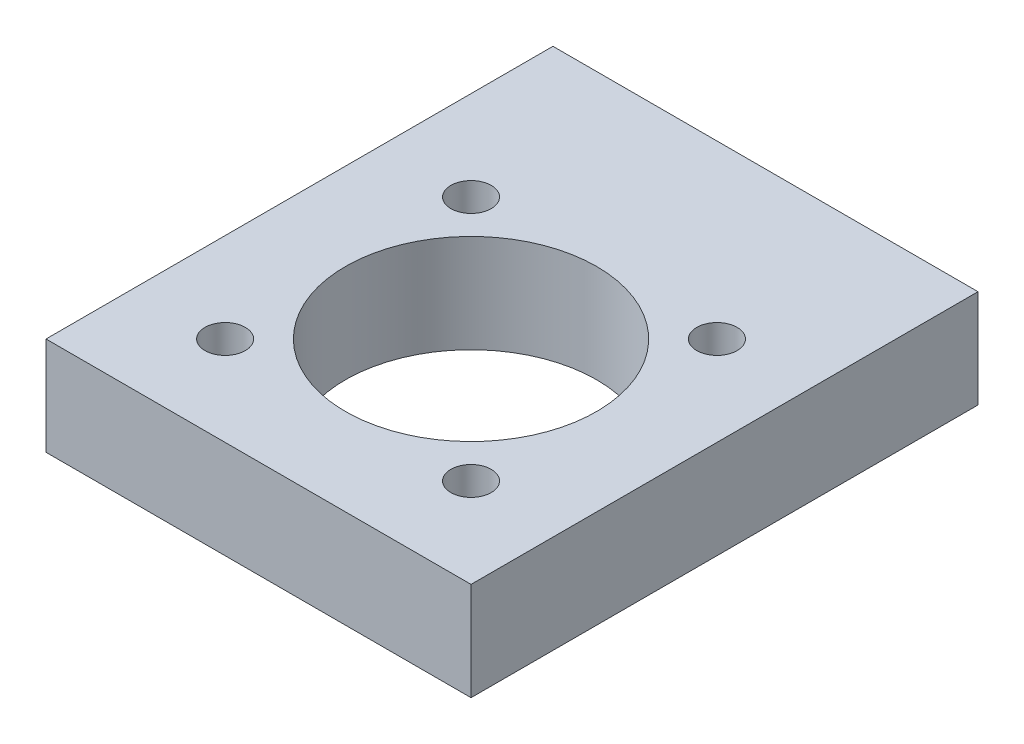
ISO-10303-21;
HEADER;
FILE_DESCRIPTION(('STEP AP214'),'2;1');
FILE_NAME('part.step','',(''),(''),'','','');
FILE_SCHEMA(('AUTOMOTIVE_DESIGN { 1 0 10303 214 1 1 1 1 }'));
ENDSEC;
DATA;
#1=APPLICATION_CONTEXT('core data for automotive mechanical design processes');
#2=APPLICATION_PROTOCOL_DEFINITION('international standard','automotive_design',2000,#1);
#3=PRODUCT_CONTEXT('',#1,'mechanical');
#4=PRODUCT('Part','Part','',(#3));
#5=PRODUCT_RELATED_PRODUCT_CATEGORY('part','',(#4));
#6=PRODUCT_DEFINITION_FORMATION('','',#4);
#7=PRODUCT_DEFINITION_CONTEXT('part definition',#1,'design');
#8=PRODUCT_DEFINITION('design','',#6,#7);
#9=PRODUCT_DEFINITION_SHAPE('','',#8);
#10=(LENGTH_UNIT() NAMED_UNIT(*) SI_UNIT(.MILLI.,.METRE.));
#11=(NAMED_UNIT(*) PLANE_ANGLE_UNIT() SI_UNIT($,.RADIAN.));
#12=(NAMED_UNIT(*) SI_UNIT($,.STERADIAN.) SOLID_ANGLE_UNIT());
#13=UNCERTAINTY_MEASURE_WITH_UNIT(LENGTH_MEASURE(1.E-05),#10,'distance_accuracy_value','');
#14=(GEOMETRIC_REPRESENTATION_CONTEXT(3) GLOBAL_UNCERTAINTY_ASSIGNED_CONTEXT((#13)) GLOBAL_UNIT_ASSIGNED_CONTEXT((#10,
#11,#12)) REPRESENTATION_CONTEXT('',''));
#15=CARTESIAN_POINT('',(0.,0.,0.));
#16=DIRECTION('',(0.,0.,1.));
#17=DIRECTION('',(1.,0.,0.));
#18=AXIS2_PLACEMENT_3D('',#15,#16,#17);
#19=CARTESIAN_POINT('',(-27.5,12.7,27.5));
#20=DIRECTION('',(0.,0.,-1.));
#21=DIRECTION('',(-1.,0.,0.));
#22=AXIS2_PLACEMENT_3D('',#19,#20,#21);
#23=PLANE('',#22);
#24=DIRECTION('',(1.,0.,0.));
#25=VECTOR('',#24,1.);
#26=CARTESIAN_POINT('',(-27.5,0.,27.5));
#27=LINE('',#26,#25);
#28=CARTESIAN_POINT('',(-27.5,0.,27.5));
#29=VERTEX_POINT('',#28);
#30=CARTESIAN_POINT('',(27.5,0.,27.5));
#31=VERTEX_POINT('',#30);
#32=EDGE_CURVE('E95',#29,#31,#27,.T.);
#33=ORIENTED_EDGE('',*,*,#32,.T.);
#34=DIRECTION('',(0.,-1.,0.));
#35=VECTOR('',#34,1.);
#36=CARTESIAN_POINT('',(27.5,12.7,27.5));
#37=LINE('',#36,#35);
#38=CARTESIAN_POINT('',(27.5,12.7,27.5));
#39=VERTEX_POINT('',#38);
#40=EDGE_CURVE('E48',#39,#31,#37,.T.);
#41=ORIENTED_EDGE('',*,*,#40,.F.);
#42=DIRECTION('',(1.,0.,0.));
#43=VECTOR('',#42,1.);
#44=CARTESIAN_POINT('',(-27.5,12.7,27.5));
#45=LINE('',#44,#43);
#46=CARTESIAN_POINT('',(-27.5,12.7,27.5));
#47=VERTEX_POINT('',#46);
#48=EDGE_CURVE('E86',#47,#39,#45,.T.);
#49=ORIENTED_EDGE('',*,*,#48,.F.);
#50=DIRECTION('',(0.,-1.,0.));
#51=VECTOR('',#50,1.);
#52=CARTESIAN_POINT('',(-27.5,12.7,27.5));
#53=LINE('',#52,#51);
#54=EDGE_CURVE('E11',#47,#29,#53,.T.);
#55=ORIENTED_EDGE('',*,*,#54,.T.);
#56=EDGE_LOOP('',(#33,#41,#49,#55));
#57=FACE_BOUND('',#56,.T.);
#58=ADVANCED_FACE('F39',(#57),#23,.F.);
#59=CARTESIAN_POINT('',(27.5,12.7,0.));
#60=DIRECTION('',(-1.,0.,0.));
#61=DIRECTION('',(0.,0.,1.));
#62=AXIS2_PLACEMENT_3D('',#59,#60,#61);
#63=PLANE('',#62);
#64=DIRECTION('',(0.,0.,-1.));
#65=VECTOR('',#64,1.);
#66=CARTESIAN_POINT('',(27.5,0.,0.));
#67=LINE('',#66,#65);
#68=CARTESIAN_POINT('',(27.5,0.,-38.1));
#69=VERTEX_POINT('',#68);
#70=EDGE_CURVE('E73',#31,#69,#67,.T.);
#71=ORIENTED_EDGE('',*,*,#70,.T.);
#72=DIRECTION('',(0.,-1.,0.));
#73=VECTOR('',#72,1.);
#74=CARTESIAN_POINT('',(27.5,12.7,-38.1));
#75=LINE('',#74,#73);
#76=CARTESIAN_POINT('',(27.5,12.7,-38.1));
#77=VERTEX_POINT('',#76);
#78=EDGE_CURVE('E97',#77,#69,#75,.T.);
#79=ORIENTED_EDGE('',*,*,#78,.F.);
#80=DIRECTION('',(0.,0.,-1.));
#81=VECTOR('',#80,1.);
#82=CARTESIAN_POINT('',(27.5,12.7,0.));
#83=LINE('',#82,#81);
#84=EDGE_CURVE('E90',#39,#77,#83,.T.);
#85=ORIENTED_EDGE('',*,*,#84,.F.);
#86=ORIENTED_EDGE('',*,*,#40,.T.);
#87=EDGE_LOOP('',(#71,#79,#85,#86));
#88=FACE_BOUND('',#87,.T.);
#89=ADVANCED_FACE('F98',(#88),#63,.F.);
#90=CARTESIAN_POINT('',(-27.5,12.7,-38.1));
#91=DIRECTION('',(0.,0.,1.));
#92=DIRECTION('',(1.,0.,0.));
#93=AXIS2_PLACEMENT_3D('',#90,#91,#92);
#94=PLANE('',#93);
#95=CARTESIAN_POINT('',(19.05,6.35,-38.1));
#96=DIRECTION('',(0.,0.,-1.));
#97=DIRECTION('',(1.,0.,0.));
#98=AXIS2_PLACEMENT_3D('',#95,#96,#97);
#99=CIRCLE('',#98,2.0193);
#100=CARTESIAN_POINT('',(21.0693,6.35,-38.1));
#101=VERTEX_POINT('',#100);
#102=EDGE_CURVE('E335',#101,#101,#99,.T.);
#103=ORIENTED_EDGE('',*,*,#102,.F.);
#104=EDGE_LOOP('',(#103));
#105=FACE_BOUND('',#104,.T.);
#106=CARTESIAN_POINT('',(-6.35,6.35,-38.1));
#107=DIRECTION('',(0.,0.,-1.));
#108=DIRECTION('',(-1.,0.,0.));
#109=AXIS2_PLACEMENT_3D('',#106,#107,#108);
#110=CIRCLE('',#109,2.0193);
#111=CARTESIAN_POINT('',(-8.3693,6.35,-38.1));
#112=VERTEX_POINT('',#111);
#113=EDGE_CURVE('E327',#112,#112,#110,.T.);
#114=ORIENTED_EDGE('',*,*,#113,.F.);
#115=EDGE_LOOP('',(#114));
#116=FACE_BOUND('',#115,.T.);
#117=CARTESIAN_POINT('',(-19.05,6.35,-38.1));
#118=DIRECTION('',(0.,0.,-1.));
#119=DIRECTION('',(-1.,0.,0.));
#120=AXIS2_PLACEMENT_3D('',#117,#118,#119);
#121=CIRCLE('',#120,2.0193);
#122=CARTESIAN_POINT('',(-21.0693,6.35,-38.1));
#123=VERTEX_POINT('',#122);
#124=EDGE_CURVE('E319',#123,#123,#121,.T.);
#125=ORIENTED_EDGE('',*,*,#124,.F.);
#126=EDGE_LOOP('',(#125));
#127=FACE_BOUND('',#126,.T.);
#128=CARTESIAN_POINT('',(6.35,6.35,-38.1));
#129=DIRECTION('',(0.,0.,-1.));
#130=DIRECTION('',(1.,0.,0.));
#131=AXIS2_PLACEMENT_3D('',#128,#129,#130);
#132=CIRCLE('',#131,2.0193);
#133=CARTESIAN_POINT('',(8.3693,6.35,-38.1));
#134=VERTEX_POINT('',#133);
#135=EDGE_CURVE('E311',#134,#134,#132,.T.);
#136=ORIENTED_EDGE('',*,*,#135,.F.);
#137=EDGE_LOOP('',(#136));
#138=FACE_BOUND('',#137,.T.);
#139=DIRECTION('',(-1.,0.,0.));
#140=VECTOR('',#139,1.);
#141=CARTESIAN_POINT('',(-27.5,0.,-38.1));
#142=LINE('',#141,#140);
#143=CARTESIAN_POINT('',(-27.5,0.,-38.1));
#144=VERTEX_POINT('',#143);
#145=EDGE_CURVE('E80',#69,#144,#142,.T.);
#146=ORIENTED_EDGE('',*,*,#145,.T.);
#147=DIRECTION('',(0.,-1.,0.));
#148=VECTOR('',#147,1.);
#149=CARTESIAN_POINT('',(-27.5,12.7,-38.1));
#150=LINE('',#149,#148);
#151=CARTESIAN_POINT('',(-27.5,12.7,-38.1));
#152=VERTEX_POINT('',#151);
#153=EDGE_CURVE('E104',#152,#144,#150,.T.);
#154=ORIENTED_EDGE('',*,*,#153,.F.);
#155=DIRECTION('',(-1.,0.,0.));
#156=VECTOR('',#155,1.);
#157=CARTESIAN_POINT('',(-27.5,12.7,-38.1));
#158=LINE('',#157,#156);
#159=EDGE_CURVE('E101',#77,#152,#158,.T.);
#160=ORIENTED_EDGE('',*,*,#159,.F.);
#161=ORIENTED_EDGE('',*,*,#78,.T.);
#162=EDGE_LOOP('',(#146,#154,#160,#161));
#163=FACE_BOUND('',#162,.T.);
#164=ADVANCED_FACE('F121',(#105,#116,#127,#138,#163),#94,.F.);
#165=CARTESIAN_POINT('',(-27.5,12.7,0.));
#166=DIRECTION('',(1.,0.,0.));
#167=DIRECTION('',(0.,0.,-1.));
#168=AXIS2_PLACEMENT_3D('',#165,#166,#167);
#169=PLANE('',#168);
#170=DIRECTION('',(0.,0.,1.));
#171=VECTOR('',#170,1.);
#172=CARTESIAN_POINT('',(-27.5,0.,0.));
#173=LINE('',#172,#171);
#174=EDGE_CURVE('E115',#144,#29,#173,.T.);
#175=ORIENTED_EDGE('',*,*,#174,.T.);
#176=ORIENTED_EDGE('',*,*,#54,.F.);
#177=DIRECTION('',(0.,0.,1.));
#178=VECTOR('',#177,1.);
#179=CARTESIAN_POINT('',(-27.5,12.7,27.5));
#180=LINE('',#179,#178);
#181=EDGE_CURVE('E56',#152,#47,#180,.T.);
#182=ORIENTED_EDGE('',*,*,#181,.F.);
#183=ORIENTED_EDGE('',*,*,#153,.T.);
#184=EDGE_LOOP('',(#175,#176,#182,#183));
#185=FACE_BOUND('',#184,.T.);
#186=ADVANCED_FACE('F125',(#185),#169,.F.);
#187=CARTESIAN_POINT('',(0.,12.7,0.));
#188=DIRECTION('',(0.,-1.,0.));
#189=DIRECTION('',(0.,0.,-1.));
#190=AXIS2_PLACEMENT_3D('',#187,#188,#189);
#191=PLANE('',#190);
#192=CARTESIAN_POINT('',(0.,12.7,0.));
#193=DIRECTION('',(0.,-1.,0.));
#194=DIRECTION('',(0.,0.,-1.));
#195=AXIS2_PLACEMENT_3D('',#192,#193,#194);
#196=CIRCLE('',#195,16.256);
#197=CARTESIAN_POINT('',(0.,12.7,-16.256));
#198=VERTEX_POINT('',#197);
#199=EDGE_CURVE('E302',#198,#198,#196,.F.);
#200=ORIENTED_EDGE('',*,*,#199,.F.);
#201=EDGE_LOOP('',(#200));
#202=FACE_BOUND('',#201,.T.);
#203=CARTESIAN_POINT('',(-15.9099025766974,12.7,-15.9099025766973));
#204=DIRECTION('',(0.,-1.,0.));
#205=DIRECTION('',(0.,0.,-1.));
#206=AXIS2_PLACEMENT_3D('',#203,#204,#205);
#207=CIRCLE('',#206,2.60985);
#208=CARTESIAN_POINT('',(-15.9099025766974,12.7,-18.5197525766973));
#209=VERTEX_POINT('',#208);
#210=EDGE_CURVE('E292',#209,#209,#207,.T.);
#211=ORIENTED_EDGE('',*,*,#210,.T.);
#212=EDGE_LOOP('',(#211));
#213=FACE_BOUND('',#212,.T.);
#214=CARTESIAN_POINT('',(15.9099025766973,12.7,15.9099025766973));
#215=DIRECTION('',(0.,-1.,0.));
#216=DIRECTION('',(0.,0.,-1.));
#217=AXIS2_PLACEMENT_3D('',#214,#215,#216);
#218=CIRCLE('',#217,2.60985);
#219=CARTESIAN_POINT('',(15.9099025766973,12.7,13.3000525766973));
#220=VERTEX_POINT('',#219);
#221=EDGE_CURVE('E285',#220,#220,#218,.T.);
#222=ORIENTED_EDGE('',*,*,#221,.T.);
#223=EDGE_LOOP('',(#222));
#224=FACE_BOUND('',#223,.T.);
#225=CARTESIAN_POINT('',(-15.9099025766974,12.7,15.9099025766973));
#226=DIRECTION('',(0.,-1.,0.));
#227=DIRECTION('',(0.,0.,-1.));
#228=AXIS2_PLACEMENT_3D('',#225,#226,#227);
#229=CIRCLE('',#228,2.60985);
#230=CARTESIAN_POINT('',(-15.9099025766974,12.7,13.3000525766973));
#231=VERTEX_POINT('',#230);
#232=EDGE_CURVE('E298',#231,#231,#229,.T.);
#233=ORIENTED_EDGE('',*,*,#232,.T.);
#234=EDGE_LOOP('',(#233));
#235=FACE_BOUND('',#234,.T.);
#236=CARTESIAN_POINT('',(15.9099025766973,12.7,-15.9099025766973));
#237=DIRECTION('',(0.,-1.,0.));
#238=DIRECTION('',(0.,0.,-1.));
#239=AXIS2_PLACEMENT_3D('',#236,#237,#238);
#240=CIRCLE('',#239,2.60985);
#241=CARTESIAN_POINT('',(15.9099025766973,12.7,-18.5197525766973));
#242=VERTEX_POINT('',#241);
#243=EDGE_CURVE('E279',#242,#242,#240,.T.);
#244=ORIENTED_EDGE('',*,*,#243,.T.);
#245=EDGE_LOOP('',(#244));
#246=FACE_BOUND('',#245,.T.);
#247=ORIENTED_EDGE('',*,*,#181,.T.);
#248=ORIENTED_EDGE('',*,*,#48,.T.);
#249=ORIENTED_EDGE('',*,*,#84,.T.);
#250=ORIENTED_EDGE('',*,*,#159,.T.);
#251=EDGE_LOOP('',(#247,#248,#249,#250));
#252=FACE_BOUND('',#251,.T.);
#253=ADVANCED_FACE('F88',(#202,#213,#224,#235,#246,#252),#191,.F.);
#254=CARTESIAN_POINT('',(0.,0.,0.));
#255=DIRECTION('',(0.,-1.,0.));
#256=DIRECTION('',(0.,0.,-1.));
#257=AXIS2_PLACEMENT_3D('',#254,#255,#256);
#258=PLANE('',#257);
#259=CARTESIAN_POINT('',(0.,0.,0.));
#260=DIRECTION('',(0.,-1.,0.));
#261=DIRECTION('',(0.,0.,-1.));
#262=AXIS2_PLACEMENT_3D('',#259,#260,#261);
#263=CIRCLE('',#262,16.256);
#264=CARTESIAN_POINT('',(0.,0.,-16.256));
#265=VERTEX_POINT('',#264);
#266=EDGE_CURVE('E263',#265,#265,#263,.T.);
#267=ORIENTED_EDGE('',*,*,#266,.F.);
#268=EDGE_LOOP('',(#267));
#269=FACE_BOUND('',#268,.T.);
#270=CARTESIAN_POINT('',(-15.9099025766974,0.,-15.9099025766973));
#271=DIRECTION('',(0.,1.,0.));
#272=DIRECTION('',(0.,0.,1.));
#273=AXIS2_PLACEMENT_3D('',#270,#271,#272);
#274=CIRCLE('',#273,2.60985);
#275=CARTESIAN_POINT('',(-15.9099025766974,0.,-13.3000525766973));
#276=VERTEX_POINT('',#275);
#277=EDGE_CURVE('E267',#276,#276,#274,.T.);
#278=ORIENTED_EDGE('',*,*,#277,.T.);
#279=EDGE_LOOP('',(#278));
#280=FACE_BOUND('',#279,.T.);
#281=CARTESIAN_POINT('',(15.9099025766973,0.,15.9099025766973));
#282=DIRECTION('',(0.,1.,0.));
#283=DIRECTION('',(0.,0.,-1.));
#284=AXIS2_PLACEMENT_3D('',#281,#282,#283);
#285=CIRCLE('',#284,2.60985);
#286=CARTESIAN_POINT('',(15.9099025766973,0.,13.3000525766973));
#287=VERTEX_POINT('',#286);
#288=EDGE_CURVE('E271',#287,#287,#285,.T.);
#289=ORIENTED_EDGE('',*,*,#288,.T.);
#290=EDGE_LOOP('',(#289));
#291=FACE_BOUND('',#290,.T.);
#292=CARTESIAN_POINT('',(-15.9099025766974,0.,15.9099025766973));
#293=DIRECTION('',(0.,1.,0.));
#294=DIRECTION('',(0.,0.,-1.));
#295=AXIS2_PLACEMENT_3D('',#292,#293,#294);
#296=CIRCLE('',#295,2.60985);
#297=CARTESIAN_POINT('',(-15.9099025766974,0.,13.3000525766973));
#298=VERTEX_POINT('',#297);
#299=EDGE_CURVE('E275',#298,#298,#296,.T.);
#300=ORIENTED_EDGE('',*,*,#299,.T.);
#301=EDGE_LOOP('',(#300));
#302=FACE_BOUND('',#301,.T.);
#303=CARTESIAN_POINT('',(15.9099025766973,0.,-15.9099025766973));
#304=DIRECTION('',(0.,1.,0.));
#305=DIRECTION('',(0.,0.,1.));
#306=AXIS2_PLACEMENT_3D('',#303,#304,#305);
#307=CIRCLE('',#306,2.60985);
#308=CARTESIAN_POINT('',(15.9099025766973,0.,-13.3000525766973));
#309=VERTEX_POINT('',#308);
#310=EDGE_CURVE('E110',#309,#309,#307,.T.);
#311=ORIENTED_EDGE('',*,*,#310,.T.);
#312=EDGE_LOOP('',(#311));
#313=FACE_BOUND('',#312,.T.);
#314=ORIENTED_EDGE('',*,*,#32,.F.);
#315=ORIENTED_EDGE('',*,*,#174,.F.);
#316=ORIENTED_EDGE('',*,*,#145,.F.);
#317=ORIENTED_EDGE('',*,*,#70,.F.);
#318=EDGE_LOOP('',(#314,#315,#316,#317));
#319=FACE_BOUND('',#318,.T.);
#320=ADVANCED_FACE('F124',(#269,#280,#291,#302,#313,#319),#258,.T.);
#321=CARTESIAN_POINT('',(15.9099025766973,12.701,-15.9099025766973));
#322=DIRECTION('',(0.,-1.,0.));
#323=DIRECTION('',(0.,0.,-1.));
#324=AXIS2_PLACEMENT_3D('',#321,#322,#323);
#325=CYLINDRICAL_SURFACE('',#324,2.60985);
#326=ORIENTED_EDGE('',*,*,#310,.F.);
#327=EDGE_LOOP('',(#326));
#328=FACE_BOUND('',#327,.T.);
#329=ORIENTED_EDGE('',*,*,#243,.F.);
#330=EDGE_LOOP('',(#329));
#331=FACE_BOUND('',#330,.T.);
#332=ADVANCED_FACE('F247',(#328,#331),#325,.F.);
#333=CARTESIAN_POINT('',(-15.9099025766974,12.701,15.9099025766973));
#334=DIRECTION('',(0.,-1.,0.));
#335=DIRECTION('',(0.,0.,-1.));
#336=AXIS2_PLACEMENT_3D('',#333,#334,#335);
#337=CYLINDRICAL_SURFACE('',#336,2.60985);
#338=ORIENTED_EDGE('',*,*,#299,.F.);
#339=EDGE_LOOP('',(#338));
#340=FACE_BOUND('',#339,.T.);
#341=ORIENTED_EDGE('',*,*,#232,.F.);
#342=EDGE_LOOP('',(#341));
#343=FACE_BOUND('',#342,.T.);
#344=ADVANCED_FACE('F243',(#340,#343),#337,.F.);
#345=CARTESIAN_POINT('',(15.9099025766973,12.701,15.9099025766973));
#346=DIRECTION('',(0.,-1.,0.));
#347=DIRECTION('',(0.,0.,-1.));
#348=AXIS2_PLACEMENT_3D('',#345,#346,#347);
#349=CYLINDRICAL_SURFACE('',#348,2.60985);
#350=ORIENTED_EDGE('',*,*,#288,.F.);
#351=EDGE_LOOP('',(#350));
#352=FACE_BOUND('',#351,.T.);
#353=ORIENTED_EDGE('',*,*,#221,.F.);
#354=EDGE_LOOP('',(#353));
#355=FACE_BOUND('',#354,.T.);
#356=ADVANCED_FACE('F246',(#352,#355),#349,.F.);
#357=CARTESIAN_POINT('',(-15.9099025766974,12.701,-15.9099025766973));
#358=DIRECTION('',(0.,-1.,0.));
#359=DIRECTION('',(0.,0.,-1.));
#360=AXIS2_PLACEMENT_3D('',#357,#358,#359);
#361=CYLINDRICAL_SURFACE('',#360,2.60985);
#362=ORIENTED_EDGE('',*,*,#277,.F.);
#363=EDGE_LOOP('',(#362));
#364=FACE_BOUND('',#363,.T.);
#365=ORIENTED_EDGE('',*,*,#210,.F.);
#366=EDGE_LOOP('',(#365));
#367=FACE_BOUND('',#366,.T.);
#368=ADVANCED_FACE('F241',(#364,#367),#361,.F.);
#369=CARTESIAN_POINT('',(0.,12.701,0.));
#370=DIRECTION('',(0.,-1.,0.));
#371=DIRECTION('',(0.,0.,-1.));
#372=AXIS2_PLACEMENT_3D('',#369,#370,#371);
#373=CYLINDRICAL_SURFACE('',#372,16.256);
#374=ORIENTED_EDGE('',*,*,#266,.T.);
#375=EDGE_LOOP('',(#374));
#376=FACE_BOUND('',#375,.T.);
#377=ORIENTED_EDGE('',*,*,#199,.T.);
#378=EDGE_LOOP('',(#377));
#379=FACE_BOUND('',#378,.T.);
#380=ADVANCED_FACE('F154',(#376,#379),#373,.F.);
#381=CARTESIAN_POINT('',(6.35,6.35,-25.4));
#382=DIRECTION('',(0.,0.,-1.));
#383=DIRECTION('',(-1.,0.,0.));
#384=AXIS2_PLACEMENT_3D('',#381,#382,#383);
#385=CYLINDRICAL_SURFACE('',#384,2.0193);
#386=CARTESIAN_POINT('',(6.35,6.35,-25.4));
#387=DIRECTION('',(0.,0.,-1.));
#388=DIRECTION('',(1.,0.,0.));
#389=AXIS2_PLACEMENT_3D('',#386,#387,#388);
#390=CIRCLE('',#389,2.0193);
#391=CARTESIAN_POINT('',(8.3693,6.35,-25.4));
#392=VERTEX_POINT('',#391);
#393=EDGE_CURVE('E315',#392,#392,#390,.T.);
#394=ORIENTED_EDGE('',*,*,#393,.F.);
#395=EDGE_LOOP('',(#394));
#396=FACE_BOUND('',#395,.T.);
#397=ORIENTED_EDGE('',*,*,#135,.T.);
#398=EDGE_LOOP('',(#397));
#399=FACE_BOUND('',#398,.T.);
#400=ADVANCED_FACE('F159',(#396,#399),#385,.F.);
#401=CARTESIAN_POINT('',(6.35,6.35,-25.4));
#402=DIRECTION('',(0.,0.,1.));
#403=DIRECTION('',(1.,0.,0.));
#404=AXIS2_PLACEMENT_3D('',#401,#402,#403);
#405=PLANE('',#404);
#406=ORIENTED_EDGE('',*,*,#393,.T.);
#407=EDGE_LOOP('',(#406));
#408=FACE_BOUND('',#407,.T.);
#409=ADVANCED_FACE('F164',(#408),#405,.F.);
#410=CARTESIAN_POINT('',(-19.05,6.35,-25.4));
#411=DIRECTION('',(0.,0.,-1.));
#412=DIRECTION('',(-1.,0.,0.));
#413=AXIS2_PLACEMENT_3D('',#410,#411,#412);
#414=CYLINDRICAL_SURFACE('',#413,2.0193);
#415=CARTESIAN_POINT('',(-19.05,6.35,-25.4));
#416=DIRECTION('',(0.,0.,-1.));
#417=DIRECTION('',(-1.,0.,0.));
#418=AXIS2_PLACEMENT_3D('',#415,#416,#417);
#419=CIRCLE('',#418,2.0193);
#420=CARTESIAN_POINT('',(-21.0693,6.35,-25.4));
#421=VERTEX_POINT('',#420);
#422=EDGE_CURVE('E323',#421,#421,#419,.T.);
#423=ORIENTED_EDGE('',*,*,#422,.F.);
#424=EDGE_LOOP('',(#423));
#425=FACE_BOUND('',#424,.T.);
#426=ORIENTED_EDGE('',*,*,#124,.T.);
#427=EDGE_LOOP('',(#426));
#428=FACE_BOUND('',#427,.T.);
#429=ADVANCED_FACE('F174',(#425,#428),#414,.F.);
#430=CARTESIAN_POINT('',(-19.05,6.35,-25.4));
#431=DIRECTION('',(0.,0.,-1.));
#432=DIRECTION('',(-1.,0.,0.));
#433=AXIS2_PLACEMENT_3D('',#430,#431,#432);
#434=PLANE('',#433);
#435=ORIENTED_EDGE('',*,*,#422,.T.);
#436=EDGE_LOOP('',(#435));
#437=FACE_BOUND('',#436,.T.);
#438=ADVANCED_FACE('F184',(#437),#434,.T.);
#439=CARTESIAN_POINT('',(-6.35,6.35,-25.4));
#440=DIRECTION('',(0.,0.,-1.));
#441=DIRECTION('',(-1.,0.,0.));
#442=AXIS2_PLACEMENT_3D('',#439,#440,#441);
#443=CYLINDRICAL_SURFACE('',#442,2.0193);
#444=CARTESIAN_POINT('',(-6.35,6.35,-25.4));
#445=DIRECTION('',(0.,0.,-1.));
#446=DIRECTION('',(-1.,0.,0.));
#447=AXIS2_PLACEMENT_3D('',#444,#445,#446);
#448=CIRCLE('',#447,2.0193);
#449=CARTESIAN_POINT('',(-8.3693,6.35,-25.4));
#450=VERTEX_POINT('',#449);
#451=EDGE_CURVE('E331',#450,#450,#448,.T.);
#452=ORIENTED_EDGE('',*,*,#451,.F.);
#453=EDGE_LOOP('',(#452));
#454=FACE_BOUND('',#453,.T.);
#455=ORIENTED_EDGE('',*,*,#113,.T.);
#456=EDGE_LOOP('',(#455));
#457=FACE_BOUND('',#456,.T.);
#458=ADVANCED_FACE('F194',(#454,#457),#443,.F.);
#459=CARTESIAN_POINT('',(-6.35,6.35,-25.4));
#460=DIRECTION('',(0.,0.,-1.));
#461=DIRECTION('',(-1.,0.,0.));
#462=AXIS2_PLACEMENT_3D('',#459,#460,#461);
#463=PLANE('',#462);
#464=ORIENTED_EDGE('',*,*,#451,.T.);
#465=EDGE_LOOP('',(#464));
#466=FACE_BOUND('',#465,.T.);
#467=ADVANCED_FACE('F204',(#466),#463,.T.);
#468=CARTESIAN_POINT('',(19.05,6.35,-25.4));
#469=DIRECTION('',(0.,0.,-1.));
#470=DIRECTION('',(-1.,0.,0.));
#471=AXIS2_PLACEMENT_3D('',#468,#469,#470);
#472=CYLINDRICAL_SURFACE('',#471,2.0193);
#473=CARTESIAN_POINT('',(19.05,6.35,-25.4));
#474=DIRECTION('',(0.,0.,-1.));
#475=DIRECTION('',(1.,0.,0.));
#476=AXIS2_PLACEMENT_3D('',#473,#474,#475);
#477=CIRCLE('',#476,2.0193);
#478=CARTESIAN_POINT('',(21.0693,6.35,-25.4));
#479=VERTEX_POINT('',#478);
#480=EDGE_CURVE('E310',#479,#479,#477,.T.);
#481=ORIENTED_EDGE('',*,*,#480,.F.);
#482=EDGE_LOOP('',(#481));
#483=FACE_BOUND('',#482,.T.);
#484=ORIENTED_EDGE('',*,*,#102,.T.);
#485=EDGE_LOOP('',(#484));
#486=FACE_BOUND('',#485,.T.);
#487=ADVANCED_FACE('F214',(#483,#486),#472,.F.);
#488=CARTESIAN_POINT('',(19.05,6.35,-25.4));
#489=DIRECTION('',(0.,0.,1.));
#490=DIRECTION('',(1.,0.,0.));
#491=AXIS2_PLACEMENT_3D('',#488,#489,#490);
#492=PLANE('',#491);
#493=ORIENTED_EDGE('',*,*,#480,.T.);
#494=EDGE_LOOP('',(#493));
#495=FACE_BOUND('',#494,.T.);
#496=ADVANCED_FACE('F224',(#495),#492,.F.);
#497=CLOSED_SHELL('',(#58,#89,#164,#186,#253,#320,#332,#344,#356,#368,#380,#400,#409,#429,#438,
#458,#467,#487,#496));
#498=MANIFOLD_SOLID_BREP('B2',#497);
#499=ADVANCED_BREP_SHAPE_REPRESENTATION('',(#18,#498),#14);
#500=SHAPE_DEFINITION_REPRESENTATION(#9,#499);
ENDSEC;
END-ISO-10303-21;
